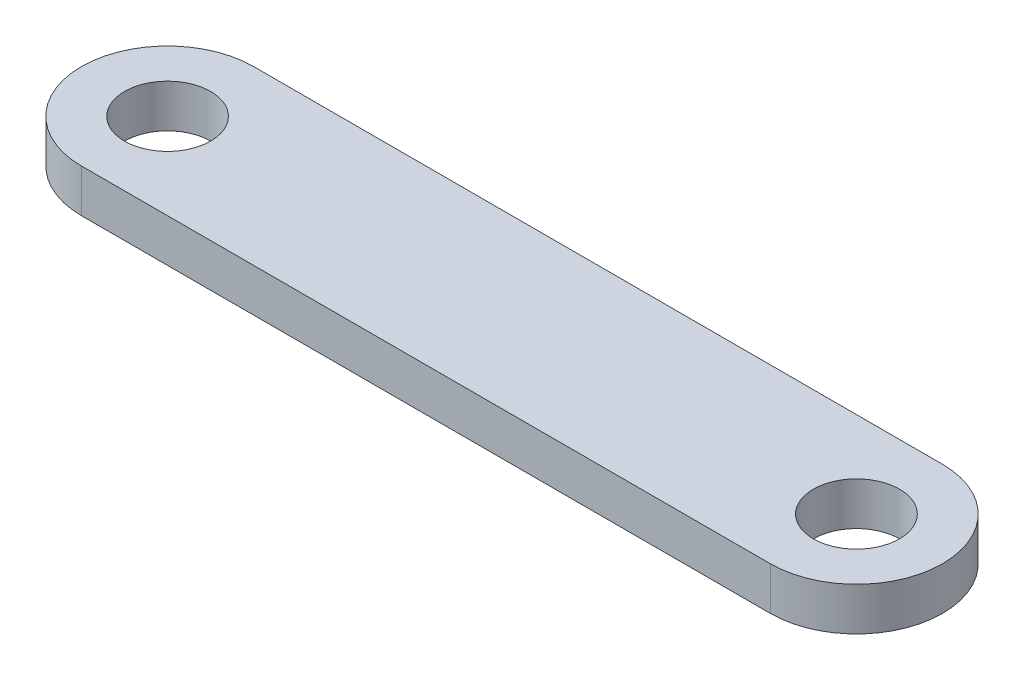
ISO-10303-21;
HEADER;
FILE_DESCRIPTION(('STEP AP214'),'2;1');
FILE_NAME('part.step','',(''),(''),'','','');
FILE_SCHEMA(('AUTOMOTIVE_DESIGN { 1 0 10303 214 1 1 1 1 }'));
ENDSEC;
DATA;
#1=APPLICATION_CONTEXT('core data for automotive mechanical design processes');
#2=APPLICATION_PROTOCOL_DEFINITION('international standard','automotive_design',2000,#1);
#3=PRODUCT_CONTEXT('',#1,'mechanical');
#4=PRODUCT('Part','Part','',(#3));
#5=PRODUCT_RELATED_PRODUCT_CATEGORY('part','',(#4));
#6=PRODUCT_DEFINITION_FORMATION('','',#4);
#7=PRODUCT_DEFINITION_CONTEXT('part definition',#1,'design');
#8=PRODUCT_DEFINITION('design','',#6,#7);
#9=PRODUCT_DEFINITION_SHAPE('','',#8);
#10=(LENGTH_UNIT() NAMED_UNIT(*) SI_UNIT(.MILLI.,.METRE.));
#11=(NAMED_UNIT(*) PLANE_ANGLE_UNIT() SI_UNIT($,.RADIAN.));
#12=(NAMED_UNIT(*) SI_UNIT($,.STERADIAN.) SOLID_ANGLE_UNIT());
#13=UNCERTAINTY_MEASURE_WITH_UNIT(LENGTH_MEASURE(1.E-05),#10,'distance_accuracy_value','');
#14=(GEOMETRIC_REPRESENTATION_CONTEXT(3) GLOBAL_UNCERTAINTY_ASSIGNED_CONTEXT((#13)) GLOBAL_UNIT_ASSIGNED_CONTEXT((#10,
#11,#12)) REPRESENTATION_CONTEXT('',''));
#15=CARTESIAN_POINT('',(0.,0.,0.));
#16=DIRECTION('',(0.,0.,1.));
#17=DIRECTION('',(1.,0.,0.));
#18=AXIS2_PLACEMENT_3D('',#15,#16,#17);
#19=CARTESIAN_POINT('',(-16.,1.,0.));
#20=DIRECTION('',(0.,1.,0.));
#21=DIRECTION('',(0.,0.,1.));
#22=AXIS2_PLACEMENT_3D('',#19,#20,#21);
#23=PLANE('',#22);
#24=CARTESIAN_POINT('',(16.,1.,0.));
#25=DIRECTION('',(0.,1.,0.));
#26=DIRECTION('',(0.,0.,1.));
#27=AXIS2_PLACEMENT_3D('',#24,#25,#26);
#28=CIRCLE('',#27,2.);
#29=CARTESIAN_POINT('',(16.,1.,2.));
#30=VERTEX_POINT('',#29);
#31=EDGE_CURVE('E106',#30,#30,#28,.T.);
#32=ORIENTED_EDGE('',*,*,#31,.F.);
#33=EDGE_LOOP('',(#32));
#34=FACE_BOUND('',#33,.T.);
#35=CARTESIAN_POINT('',(-16.,1.,0.));
#36=DIRECTION('',(0.,1.,0.));
#37=DIRECTION('',(0.,0.,1.));
#38=AXIS2_PLACEMENT_3D('',#35,#36,#37);
#39=CIRCLE('',#38,4.00000000000001);
#40=CARTESIAN_POINT('',(-16.,1.,-4.00000000000001));
#41=VERTEX_POINT('',#40);
#42=CARTESIAN_POINT('',(-16.,1.,4.00000000000001));
#43=VERTEX_POINT('',#42);
#44=EDGE_CURVE('E91',#41,#43,#39,.T.);
#45=ORIENTED_EDGE('',*,*,#44,.T.);
#46=DIRECTION('',(1.,0.,0.));
#47=VECTOR('',#46,1.);
#48=CARTESIAN_POINT('',(-16.,1.,4.00000000000001));
#49=LINE('',#48,#47);
#50=CARTESIAN_POINT('',(16.,1.,4.00000000000001));
#51=VERTEX_POINT('',#50);
#52=EDGE_CURVE('E86',#43,#51,#49,.T.);
#53=ORIENTED_EDGE('',*,*,#52,.T.);
#54=CARTESIAN_POINT('',(16.,1.,0.));
#55=DIRECTION('',(0.,1.,0.));
#56=DIRECTION('',(0.,0.,1.));
#57=AXIS2_PLACEMENT_3D('',#54,#55,#56);
#58=CIRCLE('',#57,4.00000000000001);
#59=CARTESIAN_POINT('',(16.,1.,-4.00000000000001));
#60=VERTEX_POINT('',#59);
#61=EDGE_CURVE('E89',#51,#60,#58,.T.);
#62=ORIENTED_EDGE('',*,*,#61,.T.);
#63=DIRECTION('',(-1.,0.,0.));
#64=VECTOR('',#63,1.);
#65=CARTESIAN_POINT('',(-16.,1.,-4.00000000000001));
#66=LINE('',#65,#64);
#67=EDGE_CURVE('E56',#60,#41,#66,.T.);
#68=ORIENTED_EDGE('',*,*,#67,.T.);
#69=EDGE_LOOP('',(#45,#53,#62,#68));
#70=FACE_BOUND('',#69,.T.);
#71=CARTESIAN_POINT('',(-16.,1.,0.));
#72=DIRECTION('',(0.,1.,0.));
#73=DIRECTION('',(0.,0.,1.));
#74=AXIS2_PLACEMENT_3D('',#71,#72,#73);
#75=CIRCLE('',#74,2.);
#76=CARTESIAN_POINT('',(-16.,1.,2.));
#77=VERTEX_POINT('',#76);
#78=EDGE_CURVE('E121',#77,#77,#75,.T.);
#79=ORIENTED_EDGE('',*,*,#78,.F.);
#80=EDGE_LOOP('',(#79));
#81=FACE_BOUND('',#80,.T.);
#82=ADVANCED_FACE('F39',(#34,#70,#81),#23,.T.);
#83=CARTESIAN_POINT('',(-16.,-1.,0.));
#84=DIRECTION('',(0.,1.,0.));
#85=DIRECTION('',(0.,0.,1.));
#86=AXIS2_PLACEMENT_3D('',#83,#84,#85);
#87=PLANE('',#86);
#88=CARTESIAN_POINT('',(-16.,-1.,0.));
#89=DIRECTION('',(0.,1.,0.));
#90=DIRECTION('',(0.,0.,1.));
#91=AXIS2_PLACEMENT_3D('',#88,#89,#90);
#92=CIRCLE('',#91,4.00000000000001);
#93=CARTESIAN_POINT('',(-16.,-1.,-4.00000000000001));
#94=VERTEX_POINT('',#93);
#95=CARTESIAN_POINT('',(-16.,-1.,4.00000000000001));
#96=VERTEX_POINT('',#95);
#97=EDGE_CURVE('E103',#94,#96,#92,.T.);
#98=ORIENTED_EDGE('',*,*,#97,.F.);
#99=DIRECTION('',(-1.,0.,0.));
#100=VECTOR('',#99,1.);
#101=CARTESIAN_POINT('',(-16.,-1.,-4.00000000000001));
#102=LINE('',#101,#100);
#103=CARTESIAN_POINT('',(16.,-1.,-4.00000000000001));
#104=VERTEX_POINT('',#103);
#105=EDGE_CURVE('E79',#104,#94,#102,.T.);
#106=ORIENTED_EDGE('',*,*,#105,.F.);
#107=CARTESIAN_POINT('',(16.,-1.,0.));
#108=DIRECTION('',(0.,1.,0.));
#109=DIRECTION('',(0.,0.,1.));
#110=AXIS2_PLACEMENT_3D('',#107,#108,#109);
#111=CIRCLE('',#110,4.00000000000001);
#112=CARTESIAN_POINT('',(16.,-1.,4.00000000000001));
#113=VERTEX_POINT('',#112);
#114=EDGE_CURVE('E73',#113,#104,#111,.T.);
#115=ORIENTED_EDGE('',*,*,#114,.F.);
#116=DIRECTION('',(1.,0.,0.));
#117=VECTOR('',#116,1.);
#118=CARTESIAN_POINT('',(-16.,-1.,4.00000000000001));
#119=LINE('',#118,#117);
#120=EDGE_CURVE('E95',#96,#113,#119,.T.);
#121=ORIENTED_EDGE('',*,*,#120,.F.);
#122=EDGE_LOOP('',(#98,#106,#115,#121));
#123=FACE_BOUND('',#122,.T.);
#124=CARTESIAN_POINT('',(16.,-1.,0.));
#125=DIRECTION('',(0.,1.,0.));
#126=DIRECTION('',(0.,0.,1.));
#127=AXIS2_PLACEMENT_3D('',#124,#125,#126);
#128=CIRCLE('',#127,2.);
#129=CARTESIAN_POINT('',(16.,-1.,2.));
#130=VERTEX_POINT('',#129);
#131=EDGE_CURVE('E118',#130,#130,#128,.T.);
#132=ORIENTED_EDGE('',*,*,#131,.T.);
#133=EDGE_LOOP('',(#132));
#134=FACE_BOUND('',#133,.T.);
#135=CARTESIAN_POINT('',(-16.,-1.,0.));
#136=DIRECTION('',(0.,1.,0.));
#137=DIRECTION('',(0.,0.,1.));
#138=AXIS2_PLACEMENT_3D('',#135,#136,#137);
#139=CIRCLE('',#138,2.);
#140=CARTESIAN_POINT('',(-16.,-1.,2.));
#141=VERTEX_POINT('',#140);
#142=EDGE_CURVE('E124',#141,#141,#139,.T.);
#143=ORIENTED_EDGE('',*,*,#142,.T.);
#144=EDGE_LOOP('',(#143));
#145=FACE_BOUND('',#144,.T.);
#146=ADVANCED_FACE('F114',(#123,#134,#145),#87,.F.);
#147=CARTESIAN_POINT('',(-16.,1.,0.));
#148=DIRECTION('',(0.,-1.,0.));
#149=DIRECTION('',(0.,0.,-1.));
#150=AXIS2_PLACEMENT_3D('',#147,#148,#149);
#151=CYLINDRICAL_SURFACE('',#150,4.00000000000001);
#152=ORIENTED_EDGE('',*,*,#97,.T.);
#153=DIRECTION('',(0.,-1.,0.));
#154=VECTOR('',#153,1.);
#155=CARTESIAN_POINT('',(-16.,1.,4.00000000000001));
#156=LINE('',#155,#154);
#157=EDGE_CURVE('E11',#43,#96,#156,.T.);
#158=ORIENTED_EDGE('',*,*,#157,.F.);
#159=ORIENTED_EDGE('',*,*,#44,.F.);
#160=DIRECTION('',(0.,-1.,0.));
#161=VECTOR('',#160,1.);
#162=CARTESIAN_POINT('',(-16.,1.,-4.00000000000001));
#163=LINE('',#162,#161);
#164=EDGE_CURVE('E99',#41,#94,#163,.T.);
#165=ORIENTED_EDGE('',*,*,#164,.T.);
#166=EDGE_LOOP('',(#152,#158,#159,#165));
#167=FACE_BOUND('',#166,.T.);
#168=ADVANCED_FACE('F41',(#167),#151,.T.);
#169=CARTESIAN_POINT('',(-16.,1.,4.00000000000001));
#170=DIRECTION('',(0.,0.,-1.));
#171=DIRECTION('',(-1.,0.,0.));
#172=AXIS2_PLACEMENT_3D('',#169,#170,#171);
#173=PLANE('',#172);
#174=ORIENTED_EDGE('',*,*,#120,.T.);
#175=DIRECTION('',(0.,-1.,0.));
#176=VECTOR('',#175,1.);
#177=CARTESIAN_POINT('',(16.,1.,4.00000000000001));
#178=LINE('',#177,#176);
#179=EDGE_CURVE('E48',#51,#113,#178,.T.);
#180=ORIENTED_EDGE('',*,*,#179,.F.);
#181=ORIENTED_EDGE('',*,*,#52,.F.);
#182=ORIENTED_EDGE('',*,*,#157,.T.);
#183=EDGE_LOOP('',(#174,#180,#181,#182));
#184=FACE_BOUND('',#183,.T.);
#185=ADVANCED_FACE('F94',(#184),#173,.F.);
#186=CARTESIAN_POINT('',(16.,1.,0.));
#187=DIRECTION('',(0.,-1.,0.));
#188=DIRECTION('',(0.,0.,-1.));
#189=AXIS2_PLACEMENT_3D('',#186,#187,#188);
#190=CYLINDRICAL_SURFACE('',#189,4.00000000000001);
#191=ORIENTED_EDGE('',*,*,#114,.T.);
#192=DIRECTION('',(0.,-1.,0.));
#193=VECTOR('',#192,1.);
#194=CARTESIAN_POINT('',(16.,1.,-4.00000000000001));
#195=LINE('',#194,#193);
#196=EDGE_CURVE('E96',#60,#104,#195,.T.);
#197=ORIENTED_EDGE('',*,*,#196,.F.);
#198=ORIENTED_EDGE('',*,*,#61,.F.);
#199=ORIENTED_EDGE('',*,*,#179,.T.);
#200=EDGE_LOOP('',(#191,#197,#198,#199));
#201=FACE_BOUND('',#200,.T.);
#202=ADVANCED_FACE('F97',(#201),#190,.T.);
#203=CARTESIAN_POINT('',(-16.,1.,-4.00000000000001));
#204=DIRECTION('',(0.,0.,1.));
#205=DIRECTION('',(1.,0.,0.));
#206=AXIS2_PLACEMENT_3D('',#203,#204,#205);
#207=PLANE('',#206);
#208=ORIENTED_EDGE('',*,*,#105,.T.);
#209=ORIENTED_EDGE('',*,*,#164,.F.);
#210=ORIENTED_EDGE('',*,*,#67,.F.);
#211=ORIENTED_EDGE('',*,*,#196,.T.);
#212=EDGE_LOOP('',(#208,#209,#210,#211));
#213=FACE_BOUND('',#212,.T.);
#214=ADVANCED_FACE('F111',(#213),#207,.F.);
#215=CARTESIAN_POINT('',(16.,1.,0.));
#216=DIRECTION('',(0.,-1.,0.));
#217=DIRECTION('',(0.,0.,-1.));
#218=AXIS2_PLACEMENT_3D('',#215,#216,#217);
#219=CYLINDRICAL_SURFACE('',#218,2.);
#220=ORIENTED_EDGE('',*,*,#31,.T.);
#221=EDGE_LOOP('',(#220));
#222=FACE_BOUND('',#221,.T.);
#223=ORIENTED_EDGE('',*,*,#131,.F.);
#224=EDGE_LOOP('',(#223));
#225=FACE_BOUND('',#224,.T.);
#226=ADVANCED_FACE('F141',(#222,#225),#219,.F.);
#227=CARTESIAN_POINT('',(-16.,1.,0.));
#228=DIRECTION('',(0.,-1.,0.));
#229=DIRECTION('',(0.,0.,-1.));
#230=AXIS2_PLACEMENT_3D('',#227,#228,#229);
#231=CYLINDRICAL_SURFACE('',#230,2.);
#232=ORIENTED_EDGE('',*,*,#78,.T.);
#233=EDGE_LOOP('',(#232));
#234=FACE_BOUND('',#233,.T.);
#235=ORIENTED_EDGE('',*,*,#142,.F.);
#236=EDGE_LOOP('',(#235));
#237=FACE_BOUND('',#236,.T.);
#238=ADVANCED_FACE('F130',(#234,#237),#231,.F.);
#239=CLOSED_SHELL('',(#82,#146,#168,#185,#202,#214,#226,#238));
#240=MANIFOLD_SOLID_BREP('B2',#239);
#241=ADVANCED_BREP_SHAPE_REPRESENTATION('',(#18,#240),#14);
#242=SHAPE_DEFINITION_REPRESENTATION(#9,#241);
ENDSEC;
END-ISO-10303-21;
